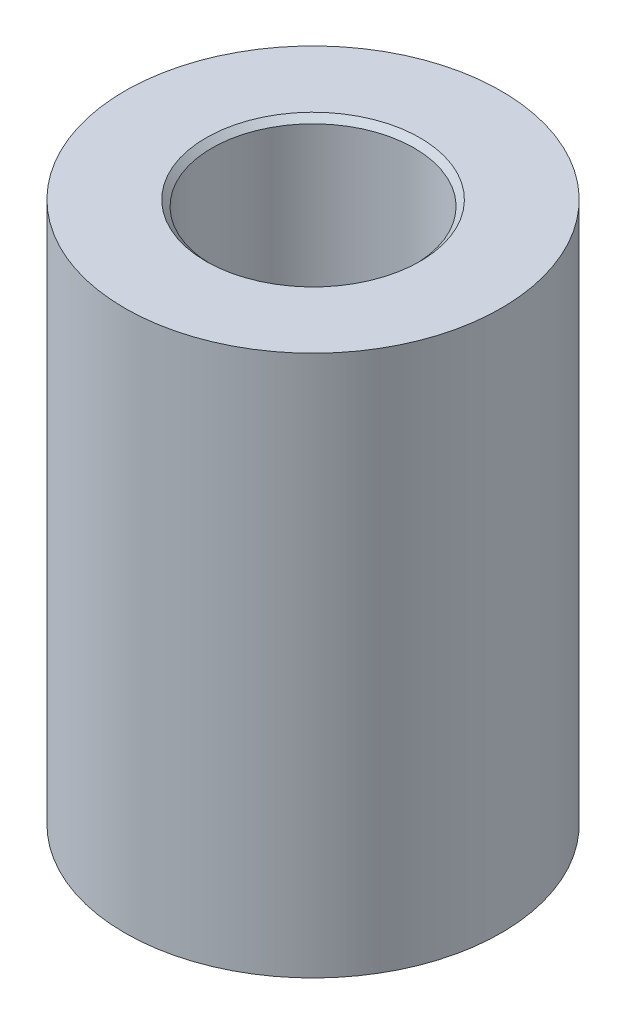
ISO-10303-21;
HEADER;
FILE_DESCRIPTION(('STEP AP214'),'2;1');
FILE_NAME('part.step','',(''),(''),'','','');
FILE_SCHEMA(('AUTOMOTIVE_DESIGN { 1 0 10303 214 1 1 1 1 }'));
ENDSEC;
DATA;
#1=APPLICATION_CONTEXT('core data for automotive mechanical design processes');
#2=APPLICATION_PROTOCOL_DEFINITION('international standard','automotive_design',2000,#1);
#3=PRODUCT_CONTEXT('',#1,'mechanical');
#4=PRODUCT('Part','Part','',(#3));
#5=PRODUCT_RELATED_PRODUCT_CATEGORY('part','',(#4));
#6=PRODUCT_DEFINITION_FORMATION('','',#4);
#7=PRODUCT_DEFINITION_CONTEXT('part definition',#1,'design');
#8=PRODUCT_DEFINITION('design','',#6,#7);
#9=PRODUCT_DEFINITION_SHAPE('','',#8);
#10=(LENGTH_UNIT() NAMED_UNIT(*) SI_UNIT(.MILLI.,.METRE.));
#11=(NAMED_UNIT(*) PLANE_ANGLE_UNIT() SI_UNIT($,.RADIAN.));
#12=(NAMED_UNIT(*) SI_UNIT($,.STERADIAN.) SOLID_ANGLE_UNIT());
#13=UNCERTAINTY_MEASURE_WITH_UNIT(LENGTH_MEASURE(1.E-05),#10,'distance_accuracy_value','');
#14=(GEOMETRIC_REPRESENTATION_CONTEXT(3) GLOBAL_UNCERTAINTY_ASSIGNED_CONTEXT((#13)) GLOBAL_UNIT_ASSIGNED_CONTEXT((#10,
#11,#12)) REPRESENTATION_CONTEXT('',''));
#15=CARTESIAN_POINT('',(0.,0.,0.));
#16=DIRECTION('',(0.,0.,1.));
#17=DIRECTION('',(1.,0.,0.));
#18=AXIS2_PLACEMENT_3D('',#15,#16,#17);
#19=CARTESIAN_POINT('',(0.,5.75,0.));
#20=DIRECTION('',(0.,-1.,0.));
#21=DIRECTION('',(0.,0.,-1.));
#22=AXIS2_PLACEMENT_3D('',#19,#20,#21);
#23=CYLINDRICAL_SURFACE('',#22,4.);
#24=CARTESIAN_POINT('',(0.,5.75,0.));
#25=DIRECTION('',(0.,1.,0.));
#26=DIRECTION('',(0.,0.,1.));
#27=AXIS2_PLACEMENT_3D('',#24,#25,#26);
#28=CIRCLE('',#27,4.);
#29=CARTESIAN_POINT('',(0.,5.75,4.));
#30=VERTEX_POINT('',#29);
#31=EDGE_CURVE('E10',#30,#30,#28,.T.);
#32=ORIENTED_EDGE('',*,*,#31,.F.);
#33=EDGE_LOOP('',(#32));
#34=FACE_BOUND('',#33,.T.);
#35=CARTESIAN_POINT('',(0.,-5.75,0.));
#36=DIRECTION('',(0.,1.,0.));
#37=DIRECTION('',(0.,0.,1.));
#38=AXIS2_PLACEMENT_3D('',#35,#36,#37);
#39=CIRCLE('',#38,4.);
#40=CARTESIAN_POINT('',(0.,-5.75,4.));
#41=VERTEX_POINT('',#40);
#42=EDGE_CURVE('E46',#41,#41,#39,.T.);
#43=ORIENTED_EDGE('',*,*,#42,.T.);
#44=EDGE_LOOP('',(#43));
#45=FACE_BOUND('',#44,.T.);
#46=ADVANCED_FACE('F43',(#34,#45),#23,.T.);
#47=CARTESIAN_POINT('',(0.,5.75,0.));
#48=DIRECTION('',(0.,1.,0.));
#49=DIRECTION('',(0.,0.,1.));
#50=AXIS2_PLACEMENT_3D('',#47,#48,#49);
#51=PLANE('',#50);
#52=CARTESIAN_POINT('',(0.,5.75,0.));
#53=DIRECTION('',(0.,1.,0.));
#54=DIRECTION('',(0.,0.,1.));
#55=AXIS2_PLACEMENT_3D('',#52,#53,#54);
#56=CIRCLE('',#55,2.275);
#57=CARTESIAN_POINT('',(0.,5.75,2.275));
#58=VERTEX_POINT('',#57);
#59=EDGE_CURVE('E64',#58,#58,#56,.T.);
#60=ORIENTED_EDGE('',*,*,#59,.F.);
#61=EDGE_LOOP('',(#60));
#62=FACE_BOUND('',#61,.T.);
#63=ORIENTED_EDGE('',*,*,#31,.T.);
#64=EDGE_LOOP('',(#63));
#65=FACE_BOUND('',#64,.T.);
#66=ADVANCED_FACE('F71',(#62,#65),#51,.T.);
#67=CARTESIAN_POINT('',(0.,-5.75,0.));
#68=DIRECTION('',(0.,1.,0.));
#69=DIRECTION('',(0.,0.,1.));
#70=AXIS2_PLACEMENT_3D('',#67,#68,#69);
#71=PLANE('',#70);
#72=CARTESIAN_POINT('',(0.,-5.75,0.));
#73=DIRECTION('',(0.,1.,0.));
#74=DIRECTION('',(0.,0.,1.));
#75=AXIS2_PLACEMENT_3D('',#72,#73,#74);
#76=CIRCLE('',#75,2.15);
#77=CARTESIAN_POINT('',(0.,-5.75,2.15));
#78=VERTEX_POINT('',#77);
#79=EDGE_CURVE('E55',#78,#78,#76,.T.);
#80=ORIENTED_EDGE('',*,*,#79,.T.);
#81=EDGE_LOOP('',(#80));
#82=FACE_BOUND('',#81,.T.);
#83=ORIENTED_EDGE('',*,*,#42,.F.);
#84=EDGE_LOOP('',(#83));
#85=FACE_BOUND('',#84,.T.);
#86=ADVANCED_FACE('F73',(#82,#85),#71,.F.);
#87=CARTESIAN_POINT('',(0.,5.75,0.));
#88=DIRECTION('',(0.,1.,0.));
#89=DIRECTION('',(0.,0.,1.));
#90=AXIS2_PLACEMENT_3D('',#87,#88,#89);
#91=CYLINDRICAL_SURFACE('',#90,2.15);
#92=ORIENTED_EDGE('',*,*,#79,.F.);
#93=EDGE_LOOP('',(#92));
#94=FACE_BOUND('',#93,.T.);
#95=CARTESIAN_POINT('',(0.,5.625,0.));
#96=DIRECTION('',(0.,1.,0.));
#97=DIRECTION('',(0.,0.,1.));
#98=AXIS2_PLACEMENT_3D('',#95,#96,#97);
#99=CIRCLE('',#98,2.15);
#100=CARTESIAN_POINT('',(0.,5.625,2.15));
#101=VERTEX_POINT('',#100);
#102=EDGE_CURVE('E60',#101,#101,#99,.T.);
#103=ORIENTED_EDGE('',*,*,#102,.T.);
#104=EDGE_LOOP('',(#103));
#105=FACE_BOUND('',#104,.T.);
#106=ADVANCED_FACE('F79',(#94,#105),#91,.F.);
#107=CARTESIAN_POINT('',(0.,5.75,0.));
#108=DIRECTION('',(0.,1.,0.));
#109=DIRECTION('',(0.,0.,1.));
#110=AXIS2_PLACEMENT_3D('',#107,#108,#109);
#111=CONICAL_SURFACE('',#110,2.275,0.785398163397443);
#112=ORIENTED_EDGE('',*,*,#102,.F.);
#113=EDGE_LOOP('',(#112));
#114=FACE_BOUND('',#113,.T.);
#115=ORIENTED_EDGE('',*,*,#59,.T.);
#116=EDGE_LOOP('',(#115));
#117=FACE_BOUND('',#116,.T.);
#118=ADVANCED_FACE('F69',(#114,#117),#111,.F.);
#119=CLOSED_SHELL('',(#46,#66,#86,#106,#118));
#120=MANIFOLD_SOLID_BREP('B2',#119);
#121=ADVANCED_BREP_SHAPE_REPRESENTATION('',(#18,#120),#14);
#122=SHAPE_DEFINITION_REPRESENTATION(#9,#121);
ENDSEC;
END-ISO-10303-21;
